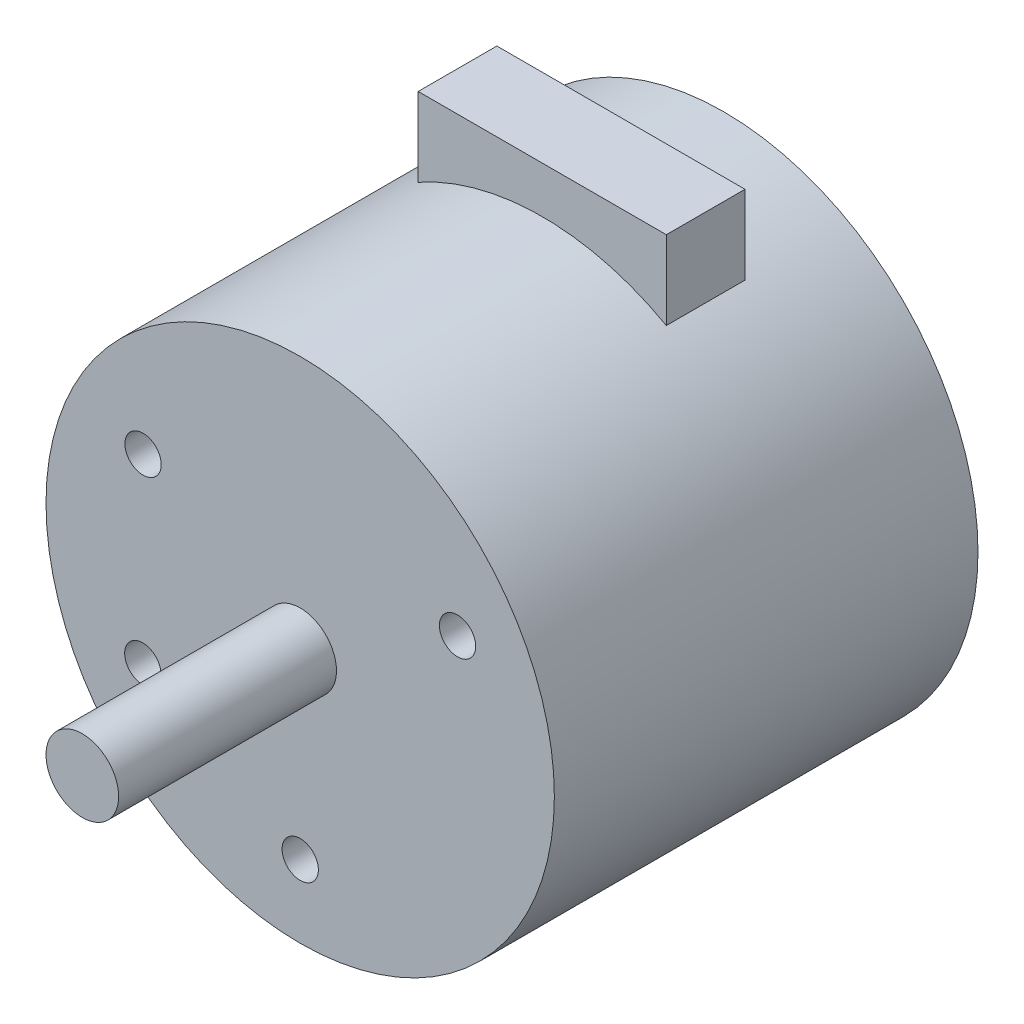
ISO-10303-21;
HEADER;
FILE_DESCRIPTION(('STEP AP214'),'2;1');
FILE_NAME('part.step','',(''),(''),'','','');
FILE_SCHEMA(('AUTOMOTIVE_DESIGN { 1 0 10303 214 1 1 1 1 }'));
ENDSEC;
DATA;
#1=APPLICATION_CONTEXT('core data for automotive mechanical design processes');
#2=APPLICATION_PROTOCOL_DEFINITION('international standard','automotive_design',2000,#1);
#3=PRODUCT_CONTEXT('',#1,'mechanical');
#4=PRODUCT('Part','Part','',(#3));
#5=PRODUCT_RELATED_PRODUCT_CATEGORY('part','',(#4));
#6=PRODUCT_DEFINITION_FORMATION('','',#4);
#7=PRODUCT_DEFINITION_CONTEXT('part definition',#1,'design');
#8=PRODUCT_DEFINITION('design','',#6,#7);
#9=PRODUCT_DEFINITION_SHAPE('','',#8);
#10=(LENGTH_UNIT() NAMED_UNIT(*) SI_UNIT(.MILLI.,.METRE.));
#11=(NAMED_UNIT(*) PLANE_ANGLE_UNIT() SI_UNIT($,.RADIAN.));
#12=(NAMED_UNIT(*) SI_UNIT($,.STERADIAN.) SOLID_ANGLE_UNIT());
#13=UNCERTAINTY_MEASURE_WITH_UNIT(LENGTH_MEASURE(1.E-05),#10,'distance_accuracy_value','');
#14=(GEOMETRIC_REPRESENTATION_CONTEXT(3) GLOBAL_UNCERTAINTY_ASSIGNED_CONTEXT((#13)) GLOBAL_UNIT_ASSIGNED_CONTEXT((#10,
#11,#12)) REPRESENTATION_CONTEXT('',''));
#15=CARTESIAN_POINT('',(0.,0.,0.));
#16=DIRECTION('',(0.,0.,1.));
#17=DIRECTION('',(1.,0.,0.));
#18=AXIS2_PLACEMENT_3D('',#15,#16,#17);
#19=CARTESIAN_POINT('',(0.,0.,35.));
#20=DIRECTION('',(0.,0.,-1.));
#21=DIRECTION('',(-1.,0.,0.));
#22=AXIS2_PLACEMENT_3D('',#19,#20,#21);
#23=CYLINDRICAL_SURFACE('',#22,21.);
#24=CARTESIAN_POINT('',(0.,0.,0.));
#25=DIRECTION('',(0.,0.,1.));
#26=DIRECTION('',(1.,0.,0.));
#27=AXIS2_PLACEMENT_3D('',#24,#25,#26);
#28=CIRCLE('',#27,21.);
#29=CARTESIAN_POINT('',(21.,0.,0.));
#30=VERTEX_POINT('',#29);
#31=EDGE_CURVE('E40',#30,#30,#28,.T.);
#32=ORIENTED_EDGE('',*,*,#31,.T.);
#33=EDGE_LOOP('',(#32));
#34=FACE_BOUND('',#33,.T.);
#35=CARTESIAN_POINT('',(0.,0.,35.));
#36=DIRECTION('',(0.,0.,1.));
#37=DIRECTION('',(1.,0.,0.));
#38=AXIS2_PLACEMENT_3D('',#35,#36,#37);
#39=CIRCLE('',#38,21.);
#40=CARTESIAN_POINT('',(21.,0.,35.));
#41=VERTEX_POINT('',#40);
#42=EDGE_CURVE('E11',#41,#41,#39,.T.);
#43=ORIENTED_EDGE('',*,*,#42,.F.);
#44=EDGE_LOOP('',(#43));
#45=FACE_BOUND('',#44,.T.);
#46=CARTESIAN_POINT('',(0.,0.,8.5));
#47=DIRECTION('',(0.,0.,1.));
#48=DIRECTION('',(1.,0.,0.));
#49=AXIS2_PLACEMENT_3D('',#46,#47,#48);
#50=CIRCLE('',#49,21.);
#51=CARTESIAN_POINT('',(10.25,18.328597873269,8.5));
#52=VERTEX_POINT('',#51);
#53=CARTESIAN_POINT('',(-10.25,18.328597873269,8.5));
#54=VERTEX_POINT('',#53);
#55=EDGE_CURVE('E60',#52,#54,#50,.T.);
#56=ORIENTED_EDGE('',*,*,#55,.F.);
#57=DIRECTION('',(0.,0.,1.));
#58=VECTOR('',#57,1.);
#59=CARTESIAN_POINT('',(10.25,18.328597873269,8.5));
#60=LINE('',#59,#58);
#61=CARTESIAN_POINT('',(10.25,18.328597873269,15.));
#62=VERTEX_POINT('',#61);
#63=EDGE_CURVE('E95',#52,#62,#60,.T.);
#64=ORIENTED_EDGE('',*,*,#63,.T.);
#65=CARTESIAN_POINT('',(0.,0.,15.));
#66=DIRECTION('',(0.,0.,1.));
#67=DIRECTION('',(1.,0.,0.));
#68=AXIS2_PLACEMENT_3D('',#65,#66,#67);
#69=CIRCLE('',#68,21.);
#70=CARTESIAN_POINT('',(-10.25,18.328597873269,15.));
#71=VERTEX_POINT('',#70);
#72=EDGE_CURVE('E108',#62,#71,#69,.T.);
#73=ORIENTED_EDGE('',*,*,#72,.T.);
#74=DIRECTION('',(0.,0.,1.));
#75=VECTOR('',#74,1.);
#76=CARTESIAN_POINT('',(-10.25,18.328597873269,8.5));
#77=LINE('',#76,#75);
#78=EDGE_CURVE('E100',#54,#71,#77,.T.);
#79=ORIENTED_EDGE('',*,*,#78,.F.);
#80=EDGE_LOOP('',(#56,#64,#73,#79));
#81=FACE_BOUND('',#80,.T.);
#82=ADVANCED_FACE('F37',(#34,#45,#81),#23,.T.);
#83=CARTESIAN_POINT('',(0.,0.,35.));
#84=DIRECTION('',(0.,0.,1.));
#85=DIRECTION('',(1.,0.,0.));
#86=AXIS2_PLACEMENT_3D('',#83,#84,#85);
#87=PLANE('',#86);
#88=CARTESIAN_POINT('',(13.,7.5,35.));
#89=DIRECTION('',(0.,0.,1.));
#90=DIRECTION('',(1.,0.,0.));
#91=AXIS2_PLACEMENT_3D('',#88,#89,#90);
#92=CIRCLE('',#91,1.5);
#93=CARTESIAN_POINT('',(14.5,7.5,35.));
#94=VERTEX_POINT('',#93);
#95=EDGE_CURVE('E105',#94,#94,#92,.T.);
#96=ORIENTED_EDGE('',*,*,#95,.F.);
#97=EDGE_LOOP('',(#96));
#98=FACE_BOUND('',#97,.T.);
#99=CARTESIAN_POINT('',(-13.,-7.5,35.));
#100=DIRECTION('',(0.,0.,1.));
#101=DIRECTION('',(1.,0.,0.));
#102=AXIS2_PLACEMENT_3D('',#99,#100,#101);
#103=CIRCLE('',#102,1.5);
#104=CARTESIAN_POINT('',(-11.5,-7.5,35.));
#105=VERTEX_POINT('',#104);
#106=EDGE_CURVE('E151',#105,#105,#103,.T.);
#107=ORIENTED_EDGE('',*,*,#106,.F.);
#108=EDGE_LOOP('',(#107));
#109=FACE_BOUND('',#108,.T.);
#110=CARTESIAN_POINT('',(0.00240940736024198,-14.9958360321666,35.));
#111=DIRECTION('',(0.,0.,1.));
#112=DIRECTION('',(1.,0.,0.));
#113=AXIS2_PLACEMENT_3D('',#110,#111,#112);
#114=CIRCLE('',#113,1.5);
#115=CARTESIAN_POINT('',(1.50240940736024,-14.9958360321666,35.));
#116=VERTEX_POINT('',#115);
#117=EDGE_CURVE('E145',#116,#116,#114,.T.);
#118=ORIENTED_EDGE('',*,*,#117,.F.);
#119=EDGE_LOOP('',(#118));
#120=FACE_BOUND('',#119,.T.);
#121=CARTESIAN_POINT('',(-12.9807607795454,7.50832562513244,35.));
#122=DIRECTION('',(0.,0.,1.));
#123=DIRECTION('',(1.,0.,0.));
#124=AXIS2_PLACEMENT_3D('',#121,#122,#123);
#125=CIRCLE('',#124,1.5);
#126=CARTESIAN_POINT('',(-11.4807607795454,7.50832562513244,35.));
#127=VERTEX_POINT('',#126);
#128=EDGE_CURVE('E138',#127,#127,#125,.T.);
#129=ORIENTED_EDGE('',*,*,#128,.F.);
#130=EDGE_LOOP('',(#129));
#131=FACE_BOUND('',#130,.T.);
#132=CARTESIAN_POINT('',(0.,0.,35.));
#133=DIRECTION('',(0.,0.,1.));
#134=DIRECTION('',(1.,0.,0.));
#135=AXIS2_PLACEMENT_3D('',#132,#133,#134);
#136=CIRCLE('',#135,3.);
#137=CARTESIAN_POINT('',(3.,0.,35.));
#138=VERTEX_POINT('',#137);
#139=EDGE_CURVE('E114',#138,#138,#136,.T.);
#140=ORIENTED_EDGE('',*,*,#139,.F.);
#141=EDGE_LOOP('',(#140));
#142=FACE_BOUND('',#141,.T.);
#143=ORIENTED_EDGE('',*,*,#42,.T.);
#144=EDGE_LOOP('',(#143));
#145=FACE_BOUND('',#144,.T.);
#146=ADVANCED_FACE('F123',(#98,#109,#120,#131,#142,#145),#87,.T.);
#147=CARTESIAN_POINT('',(0.,0.,0.));
#148=DIRECTION('',(0.,0.,1.));
#149=DIRECTION('',(1.,0.,0.));
#150=AXIS2_PLACEMENT_3D('',#147,#148,#149);
#151=PLANE('',#150);
#152=CARTESIAN_POINT('',(-12.999999999999,-7.4999999999936,0.));
#153=DIRECTION('',(0.,0.,1.));
#154=DIRECTION('',(1.,0.,0.));
#155=AXIS2_PLACEMENT_3D('',#152,#153,#154);
#156=CIRCLE('',#155,1.49999999999998);
#157=CARTESIAN_POINT('',(-11.499999999999,-7.4999999999936,0.));
#158=VERTEX_POINT('',#157);
#159=EDGE_CURVE('E158',#158,#158,#156,.T.);
#160=ORIENTED_EDGE('',*,*,#159,.T.);
#161=EDGE_LOOP('',(#160));
#162=FACE_BOUND('',#161,.T.);
#163=CARTESIAN_POINT('',(13.0000000000008,7.50000000000597,0.));
#164=DIRECTION('',(0.,0.,1.));
#165=DIRECTION('',(1.,0.,0.));
#166=AXIS2_PLACEMENT_3D('',#163,#164,#165);
#167=CIRCLE('',#166,1.50000000000001);
#168=CARTESIAN_POINT('',(14.5000000000008,7.50000000000597,0.));
#169=VERTEX_POINT('',#168);
#170=EDGE_CURVE('E142',#169,#169,#167,.T.);
#171=ORIENTED_EDGE('',*,*,#170,.T.);
#172=EDGE_LOOP('',(#171));
#173=FACE_BOUND('',#172,.T.);
#174=ORIENTED_EDGE('',*,*,#31,.F.);
#175=EDGE_LOOP('',(#174));
#176=FACE_BOUND('',#175,.T.);
#177=ADVANCED_FACE('F126',(#162,#173,#176),#151,.F.);
#178=CARTESIAN_POINT('',(0.,0.,53.));
#179=DIRECTION('',(0.,0.,-1.));
#180=DIRECTION('',(-1.,0.,0.));
#181=AXIS2_PLACEMENT_3D('',#178,#179,#180);
#182=CYLINDRICAL_SURFACE('',#181,3.);
#183=CARTESIAN_POINT('',(0.,0.,53.));
#184=DIRECTION('',(0.,0.,1.));
#185=DIRECTION('',(1.,0.,0.));
#186=AXIS2_PLACEMENT_3D('',#183,#184,#185);
#187=CIRCLE('',#186,3.);
#188=CARTESIAN_POINT('',(3.,0.,53.));
#189=VERTEX_POINT('',#188);
#190=EDGE_CURVE('E115',#189,#189,#187,.T.);
#191=ORIENTED_EDGE('',*,*,#190,.F.);
#192=EDGE_LOOP('',(#191));
#193=FACE_BOUND('',#192,.T.);
#194=ORIENTED_EDGE('',*,*,#139,.T.);
#195=EDGE_LOOP('',(#194));
#196=FACE_BOUND('',#195,.T.);
#197=ADVANCED_FACE('F121',(#193,#196),#182,.T.);
#198=CARTESIAN_POINT('',(0.,0.,53.));
#199=DIRECTION('',(0.,0.,1.));
#200=DIRECTION('',(1.,0.,0.));
#201=AXIS2_PLACEMENT_3D('',#198,#199,#200);
#202=PLANE('',#201);
#203=ORIENTED_EDGE('',*,*,#190,.T.);
#204=EDGE_LOOP('',(#203));
#205=FACE_BOUND('',#204,.T.);
#206=ADVANCED_FACE('F202',(#205),#202,.T.);
#207=CARTESIAN_POINT('',(-10.25,18.328597873269,8.5));
#208=DIRECTION('',(1.,0.,0.));
#209=DIRECTION('',(0.,0.,-1.));
#210=AXIS2_PLACEMENT_3D('',#207,#208,#209);
#211=PLANE('',#210);
#212=DIRECTION('',(0.,1.,0.));
#213=VECTOR('',#212,1.);
#214=CARTESIAN_POINT('',(-10.25,18.328597873269,15.));
#215=LINE('',#214,#213);
#216=CARTESIAN_POINT('',(-10.25,24.828597873269,15.));
#217=VERTEX_POINT('',#216);
#218=EDGE_CURVE('E51',#71,#217,#215,.T.);
#219=ORIENTED_EDGE('',*,*,#218,.T.);
#220=DIRECTION('',(0.,0.,1.));
#221=VECTOR('',#220,1.);
#222=CARTESIAN_POINT('',(-10.25,24.828597873269,8.5));
#223=LINE('',#222,#221);
#224=CARTESIAN_POINT('',(-10.25,24.828597873269,8.5));
#225=VERTEX_POINT('',#224);
#226=EDGE_CURVE('E94',#225,#217,#223,.T.);
#227=ORIENTED_EDGE('',*,*,#226,.F.);
#228=DIRECTION('',(0.,1.,0.));
#229=VECTOR('',#228,1.);
#230=CARTESIAN_POINT('',(-10.25,18.328597873269,8.5));
#231=LINE('',#230,#229);
#232=EDGE_CURVE('E88',#54,#225,#231,.T.);
#233=ORIENTED_EDGE('',*,*,#232,.F.);
#234=ORIENTED_EDGE('',*,*,#78,.T.);
#235=EDGE_LOOP('',(#219,#227,#233,#234));
#236=FACE_BOUND('',#235,.T.);
#237=ADVANCED_FACE('F136',(#236),#211,.F.);
#238=CARTESIAN_POINT('',(10.25,24.828597873269,8.5));
#239=DIRECTION('',(0.,-1.,0.));
#240=DIRECTION('',(0.,0.,-1.));
#241=AXIS2_PLACEMENT_3D('',#238,#239,#240);
#242=PLANE('',#241);
#243=DIRECTION('',(1.,0.,0.));
#244=VECTOR('',#243,1.);
#245=CARTESIAN_POINT('',(10.25,24.828597873269,15.));
#246=LINE('',#245,#244);
#247=CARTESIAN_POINT('',(10.25,24.828597873269,15.));
#248=VERTEX_POINT('',#247);
#249=EDGE_CURVE('E93',#217,#248,#246,.T.);
#250=ORIENTED_EDGE('',*,*,#249,.T.);
#251=DIRECTION('',(0.,0.,1.));
#252=VECTOR('',#251,1.);
#253=CARTESIAN_POINT('',(10.25,24.828597873269,8.5));
#254=LINE('',#253,#252);
#255=CARTESIAN_POINT('',(10.25,24.828597873269,8.5));
#256=VERTEX_POINT('',#255);
#257=EDGE_CURVE('E91',#256,#248,#254,.T.);
#258=ORIENTED_EDGE('',*,*,#257,.F.);
#259=DIRECTION('',(1.,0.,0.));
#260=VECTOR('',#259,1.);
#261=CARTESIAN_POINT('',(10.25,24.828597873269,8.5));
#262=LINE('',#261,#260);
#263=EDGE_CURVE('E84',#225,#256,#262,.T.);
#264=ORIENTED_EDGE('',*,*,#263,.F.);
#265=ORIENTED_EDGE('',*,*,#226,.T.);
#266=EDGE_LOOP('',(#250,#258,#264,#265));
#267=FACE_BOUND('',#266,.T.);
#268=ADVANCED_FACE('F92',(#267),#242,.F.);
#269=CARTESIAN_POINT('',(10.25,18.328597873269,8.5));
#270=DIRECTION('',(-1.,0.,0.));
#271=DIRECTION('',(0.,0.,1.));
#272=AXIS2_PLACEMENT_3D('',#269,#270,#271);
#273=PLANE('',#272);
#274=DIRECTION('',(0.,-1.,0.));
#275=VECTOR('',#274,1.);
#276=CARTESIAN_POINT('',(10.25,18.328597873269,15.));
#277=LINE('',#276,#275);
#278=EDGE_CURVE('E77',#248,#62,#277,.T.);
#279=ORIENTED_EDGE('',*,*,#278,.T.);
#280=ORIENTED_EDGE('',*,*,#63,.F.);
#281=DIRECTION('',(0.,-1.,0.));
#282=VECTOR('',#281,1.);
#283=CARTESIAN_POINT('',(10.25,18.328597873269,8.5));
#284=LINE('',#283,#282);
#285=EDGE_CURVE('E87',#256,#52,#284,.T.);
#286=ORIENTED_EDGE('',*,*,#285,.F.);
#287=ORIENTED_EDGE('',*,*,#257,.T.);
#288=EDGE_LOOP('',(#279,#280,#286,#287));
#289=FACE_BOUND('',#288,.T.);
#290=ADVANCED_FACE('F97',(#289),#273,.F.);
#291=CARTESIAN_POINT('',(0.,0.,8.5));
#292=DIRECTION('',(0.,0.,1.));
#293=DIRECTION('',(1.,0.,0.));
#294=AXIS2_PLACEMENT_3D('',#291,#292,#293);
#295=PLANE('',#294);
#296=ORIENTED_EDGE('',*,*,#232,.T.);
#297=ORIENTED_EDGE('',*,*,#263,.T.);
#298=ORIENTED_EDGE('',*,*,#285,.T.);
#299=ORIENTED_EDGE('',*,*,#55,.T.);
#300=EDGE_LOOP('',(#296,#297,#298,#299));
#301=FACE_BOUND('',#300,.T.);
#302=ADVANCED_FACE('F85',(#301),#295,.F.);
#303=CARTESIAN_POINT('',(0.,0.,15.));
#304=DIRECTION('',(0.,0.,1.));
#305=DIRECTION('',(1.,0.,0.));
#306=AXIS2_PLACEMENT_3D('',#303,#304,#305);
#307=PLANE('',#306);
#308=ORIENTED_EDGE('',*,*,#218,.F.);
#309=ORIENTED_EDGE('',*,*,#72,.F.);
#310=ORIENTED_EDGE('',*,*,#278,.F.);
#311=ORIENTED_EDGE('',*,*,#249,.F.);
#312=EDGE_LOOP('',(#308,#309,#310,#311));
#313=FACE_BOUND('',#312,.T.);
#314=ADVANCED_FACE('F190',(#313),#307,.T.);
#315=CARTESIAN_POINT('',(-12.9807607795454,7.50832562513244,28.5));
#316=DIRECTION('',(0.,0.,1.));
#317=DIRECTION('',(1.,0.,0.));
#318=AXIS2_PLACEMENT_3D('',#315,#316,#317);
#319=CYLINDRICAL_SURFACE('',#318,1.5);
#320=CARTESIAN_POINT('',(-12.9807607795454,7.50832562513244,28.5));
#321=DIRECTION('',(0.,0.,1.));
#322=DIRECTION('',(1.,0.,0.));
#323=AXIS2_PLACEMENT_3D('',#320,#321,#322);
#324=CIRCLE('',#323,1.5);
#325=CARTESIAN_POINT('',(-11.4807607795454,7.50832562513244,28.5));
#326=VERTEX_POINT('',#325);
#327=EDGE_CURVE('E141',#326,#326,#324,.T.);
#328=ORIENTED_EDGE('',*,*,#327,.F.);
#329=EDGE_LOOP('',(#328));
#330=FACE_BOUND('',#329,.T.);
#331=ORIENTED_EDGE('',*,*,#128,.T.);
#332=EDGE_LOOP('',(#331));
#333=FACE_BOUND('',#332,.T.);
#334=ADVANCED_FACE('F186',(#330,#333),#319,.F.);
#335=CARTESIAN_POINT('',(-12.9807607795454,7.50832562513244,28.5));
#336=DIRECTION('',(0.,0.,1.));
#337=DIRECTION('',(1.,0.,0.));
#338=AXIS2_PLACEMENT_3D('',#335,#336,#337);
#339=PLANE('',#338);
#340=ORIENTED_EDGE('',*,*,#327,.T.);
#341=EDGE_LOOP('',(#340));
#342=FACE_BOUND('',#341,.T.);
#343=ADVANCED_FACE('F182',(#342),#339,.T.);
#344=CARTESIAN_POINT('',(0.00240940736024198,-14.9958360321666,28.5));
#345=DIRECTION('',(0.,0.,1.));
#346=DIRECTION('',(1.,0.,0.));
#347=AXIS2_PLACEMENT_3D('',#344,#345,#346);
#348=CYLINDRICAL_SURFACE('',#347,1.5);
#349=CARTESIAN_POINT('',(0.00240940736024198,-14.9958360321666,28.5));
#350=DIRECTION('',(0.,0.,1.));
#351=DIRECTION('',(1.,0.,0.));
#352=AXIS2_PLACEMENT_3D('',#349,#350,#351);
#353=CIRCLE('',#352,1.5);
#354=CARTESIAN_POINT('',(1.50240940736024,-14.9958360321666,28.5));
#355=VERTEX_POINT('',#354);
#356=EDGE_CURVE('E148',#355,#355,#353,.T.);
#357=ORIENTED_EDGE('',*,*,#356,.F.);
#358=EDGE_LOOP('',(#357));
#359=FACE_BOUND('',#358,.T.);
#360=ORIENTED_EDGE('',*,*,#117,.T.);
#361=EDGE_LOOP('',(#360));
#362=FACE_BOUND('',#361,.T.);
#363=ADVANCED_FACE('F176',(#359,#362),#348,.F.);
#364=CARTESIAN_POINT('',(0.00240940736024198,-14.9958360321666,28.5));
#365=DIRECTION('',(0.,0.,1.));
#366=DIRECTION('',(1.,0.,0.));
#367=AXIS2_PLACEMENT_3D('',#364,#365,#366);
#368=PLANE('',#367);
#369=ORIENTED_EDGE('',*,*,#356,.T.);
#370=EDGE_LOOP('',(#369));
#371=FACE_BOUND('',#370,.T.);
#372=ADVANCED_FACE('F167',(#371),#368,.T.);
#373=CARTESIAN_POINT('',(-13.,-7.5,28.5));
#374=DIRECTION('',(0.,0.,1.));
#375=DIRECTION('',(1.,0.,0.));
#376=AXIS2_PLACEMENT_3D('',#373,#374,#375);
#377=CYLINDRICAL_SURFACE('',#376,1.5);
#378=ORIENTED_EDGE('',*,*,#106,.T.);
#379=EDGE_LOOP('',(#378));
#380=FACE_BOUND('',#379,.T.);
#381=ORIENTED_EDGE('',*,*,#159,.F.);
#382=EDGE_LOOP('',(#381));
#383=FACE_BOUND('',#382,.T.);
#384=ADVANCED_FACE('F164',(#380,#383),#377,.F.);
#385=CARTESIAN_POINT('',(13.,7.5,28.5));
#386=DIRECTION('',(0.,0.,1.));
#387=DIRECTION('',(1.,0.,0.));
#388=AXIS2_PLACEMENT_3D('',#385,#386,#387);
#389=CYLINDRICAL_SURFACE('',#388,1.5);
#390=ORIENTED_EDGE('',*,*,#95,.T.);
#391=EDGE_LOOP('',(#390));
#392=FACE_BOUND('',#391,.T.);
#393=ORIENTED_EDGE('',*,*,#170,.F.);
#394=EDGE_LOOP('',(#393));
#395=FACE_BOUND('',#394,.T.);
#396=ADVANCED_FACE('F166',(#392,#395),#389,.F.);
#397=CLOSED_SHELL('',(#82,#146,#177,#197,#206,#237,#268,#290,#302,#314,#334,#343,#363,#372,#384,#396));
#398=MANIFOLD_SOLID_BREP('B2',#397);
#399=ADVANCED_BREP_SHAPE_REPRESENTATION('',(#18,#398),#14);
#400=SHAPE_DEFINITION_REPRESENTATION(#9,#399);
ENDSEC;
END-ISO-10303-21;
